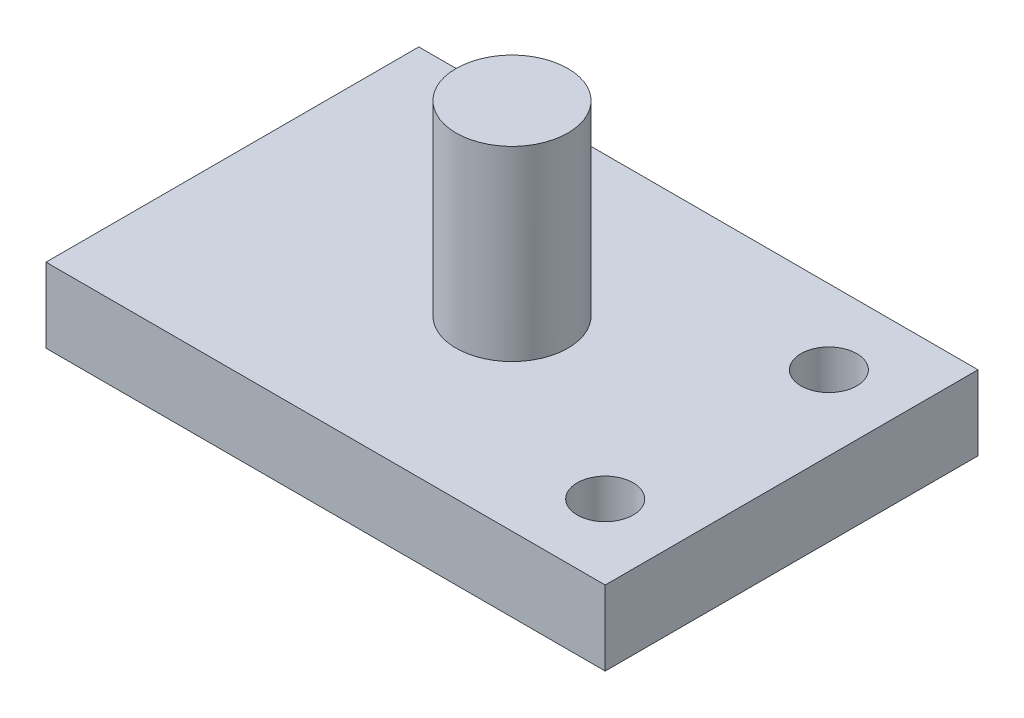
ISO-10303-21;
HEADER;
FILE_DESCRIPTION(('STEP AP214'),'2;1');
FILE_NAME('part.step','',(''),(''),'','','');
FILE_SCHEMA(('AUTOMOTIVE_DESIGN { 1 0 10303 214 1 1 1 1 }'));
ENDSEC;
DATA;
#1=APPLICATION_CONTEXT('core data for automotive mechanical design processes');
#2=APPLICATION_PROTOCOL_DEFINITION('international standard','automotive_design',2000,#1);
#3=PRODUCT_CONTEXT('',#1,'mechanical');
#4=PRODUCT('Part','Part','',(#3));
#5=PRODUCT_RELATED_PRODUCT_CATEGORY('part','',(#4));
#6=PRODUCT_DEFINITION_FORMATION('','',#4);
#7=PRODUCT_DEFINITION_CONTEXT('part definition',#1,'design');
#8=PRODUCT_DEFINITION('design','',#6,#7);
#9=PRODUCT_DEFINITION_SHAPE('','',#8);
#10=(LENGTH_UNIT() NAMED_UNIT(*) SI_UNIT(.MILLI.,.METRE.));
#11=(NAMED_UNIT(*) PLANE_ANGLE_UNIT() SI_UNIT($,.RADIAN.));
#12=(NAMED_UNIT(*) SI_UNIT($,.STERADIAN.) SOLID_ANGLE_UNIT());
#13=UNCERTAINTY_MEASURE_WITH_UNIT(LENGTH_MEASURE(1.E-05),#10,'distance_accuracy_value','');
#14=(GEOMETRIC_REPRESENTATION_CONTEXT(3) GLOBAL_UNCERTAINTY_ASSIGNED_CONTEXT((#13)) GLOBAL_UNIT_ASSIGNED_CONTEXT((#10,
#11,#12)) REPRESENTATION_CONTEXT('',''));
#15=CARTESIAN_POINT('',(0.,0.,0.));
#16=DIRECTION('',(0.,0.,1.));
#17=DIRECTION('',(1.,0.,0.));
#18=AXIS2_PLACEMENT_3D('',#15,#16,#17);
#19=CARTESIAN_POINT('',(0.,20.,0.));
#20=DIRECTION('',(0.,-1.,0.));
#21=DIRECTION('',(0.,0.,-1.));
#22=AXIS2_PLACEMENT_3D('',#19,#20,#21);
#23=PLANE('',#22);
#24=CARTESIAN_POINT('',(55.,20.,30.));
#25=DIRECTION('',(0.,1.,0.));
#26=DIRECTION('',(0.,0.,1.));
#27=AXIS2_PLACEMENT_3D('',#24,#25,#26);
#28=CIRCLE('',#27,7.5);
#29=CARTESIAN_POINT('',(55.,20.,37.5));
#30=VERTEX_POINT('',#29);
#31=EDGE_CURVE('E152',#30,#30,#28,.T.);
#32=ORIENTED_EDGE('',*,*,#31,.F.);
#33=EDGE_LOOP('',(#32));
#34=FACE_BOUND('',#33,.T.);
#35=CARTESIAN_POINT('',(55.,20.,-30.));
#36=DIRECTION('',(0.,1.,0.));
#37=DIRECTION('',(0.,0.,1.));
#38=AXIS2_PLACEMENT_3D('',#35,#36,#37);
#39=CIRCLE('',#38,7.5);
#40=CARTESIAN_POINT('',(55.,20.,-22.5));
#41=VERTEX_POINT('',#40);
#42=EDGE_CURVE('E154',#41,#41,#39,.T.);
#43=ORIENTED_EDGE('',*,*,#42,.F.);
#44=EDGE_LOOP('',(#43));
#45=FACE_BOUND('',#44,.T.);
#46=DIRECTION('',(0.,0.,-1.));
#47=VECTOR('',#46,1.);
#48=CARTESIAN_POINT('',(75.,20.,50.));
#49=LINE('',#48,#47);
#50=CARTESIAN_POINT('',(75.,20.,50.));
#51=VERTEX_POINT('',#50);
#52=CARTESIAN_POINT('',(75.,20.,-50.));
#53=VERTEX_POINT('',#52);
#54=EDGE_CURVE('E86',#51,#53,#49,.T.);
#55=ORIENTED_EDGE('',*,*,#54,.T.);
#56=DIRECTION('',(-1.,0.,0.));
#57=VECTOR('',#56,1.);
#58=CARTESIAN_POINT('',(-75.,20.,-50.));
#59=LINE('',#58,#57);
#60=CARTESIAN_POINT('',(-75.,20.,-50.));
#61=VERTEX_POINT('',#60);
#62=EDGE_CURVE('E81',#53,#61,#59,.T.);
#63=ORIENTED_EDGE('',*,*,#62,.T.);
#64=DIRECTION('',(0.,0.,1.));
#65=VECTOR('',#64,1.);
#66=CARTESIAN_POINT('',(-75.,20.,50.));
#67=LINE('',#66,#65);
#68=CARTESIAN_POINT('',(-75.,20.,50.));
#69=VERTEX_POINT('',#68);
#70=EDGE_CURVE('E84',#61,#69,#67,.T.);
#71=ORIENTED_EDGE('',*,*,#70,.T.);
#72=DIRECTION('',(1.,0.,0.));
#73=VECTOR('',#72,1.);
#74=CARTESIAN_POINT('',(-75.,20.,50.));
#75=LINE('',#74,#73);
#76=EDGE_CURVE('E50',#69,#51,#75,.T.);
#77=ORIENTED_EDGE('',*,*,#76,.T.);
#78=EDGE_LOOP('',(#55,#63,#71,#77));
#79=FACE_BOUND('',#78,.T.);
#80=CARTESIAN_POINT('',(0.,20.,0.));
#81=DIRECTION('',(0.,-1.,0.));
#82=DIRECTION('',(0.,0.,-1.));
#83=AXIS2_PLACEMENT_3D('',#80,#81,#82);
#84=CIRCLE('',#83,15.);
#85=CARTESIAN_POINT('',(0.,20.,-15.));
#86=VERTEX_POINT('',#85);
#87=EDGE_CURVE('E11',#86,#86,#84,.F.);
#88=ORIENTED_EDGE('',*,*,#87,.F.);
#89=EDGE_LOOP('',(#88));
#90=FACE_BOUND('',#89,.T.);
#91=ADVANCED_FACE('F33',(#34,#45,#79,#90),#23,.F.);
#92=CARTESIAN_POINT('',(75.,20.,50.));
#93=DIRECTION('',(-1.,0.,0.));
#94=DIRECTION('',(0.,0.,1.));
#95=AXIS2_PLACEMENT_3D('',#92,#93,#94);
#96=PLANE('',#95);
#97=DIRECTION('',(0.,0.,-1.));
#98=VECTOR('',#97,1.);
#99=CARTESIAN_POINT('',(75.,0.,50.));
#100=LINE('',#99,#98);
#101=CARTESIAN_POINT('',(75.,0.,50.));
#102=VERTEX_POINT('',#101);
#103=CARTESIAN_POINT('',(75.,0.,-50.));
#104=VERTEX_POINT('',#103);
#105=EDGE_CURVE('E100',#102,#104,#100,.T.);
#106=ORIENTED_EDGE('',*,*,#105,.T.);
#107=DIRECTION('',(0.,-1.,0.));
#108=VECTOR('',#107,1.);
#109=CARTESIAN_POINT('',(75.,20.,-50.));
#110=LINE('',#109,#108);
#111=EDGE_CURVE('E42',#53,#104,#110,.T.);
#112=ORIENTED_EDGE('',*,*,#111,.F.);
#113=ORIENTED_EDGE('',*,*,#54,.F.);
#114=DIRECTION('',(0.,-1.,0.));
#115=VECTOR('',#114,1.);
#116=CARTESIAN_POINT('',(75.,20.,50.));
#117=LINE('',#116,#115);
#118=EDGE_CURVE('E96',#51,#102,#117,.T.);
#119=ORIENTED_EDGE('',*,*,#118,.T.);
#120=EDGE_LOOP('',(#106,#112,#113,#119));
#121=FACE_BOUND('',#120,.T.);
#122=ADVANCED_FACE('F35',(#121),#96,.F.);
#123=CARTESIAN_POINT('',(-75.,20.,-50.));
#124=DIRECTION('',(0.,0.,1.));
#125=DIRECTION('',(1.,0.,0.));
#126=AXIS2_PLACEMENT_3D('',#123,#124,#125);
#127=PLANE('',#126);
#128=DIRECTION('',(-1.,0.,0.));
#129=VECTOR('',#128,1.);
#130=CARTESIAN_POINT('',(-75.,0.,-50.));
#131=LINE('',#130,#129);
#132=CARTESIAN_POINT('',(-75.,0.,-50.));
#133=VERTEX_POINT('',#132);
#134=EDGE_CURVE('E91',#104,#133,#131,.T.);
#135=ORIENTED_EDGE('',*,*,#134,.T.);
#136=DIRECTION('',(0.,-1.,0.));
#137=VECTOR('',#136,1.);
#138=CARTESIAN_POINT('',(-75.,20.,-50.));
#139=LINE('',#138,#137);
#140=EDGE_CURVE('E89',#61,#133,#139,.T.);
#141=ORIENTED_EDGE('',*,*,#140,.F.);
#142=ORIENTED_EDGE('',*,*,#62,.F.);
#143=ORIENTED_EDGE('',*,*,#111,.T.);
#144=EDGE_LOOP('',(#135,#141,#142,#143));
#145=FACE_BOUND('',#144,.T.);
#146=ADVANCED_FACE('F90',(#145),#127,.F.);
#147=CARTESIAN_POINT('',(-75.,20.,50.));
#148=DIRECTION('',(1.,0.,0.));
#149=DIRECTION('',(0.,0.,-1.));
#150=AXIS2_PLACEMENT_3D('',#147,#148,#149);
#151=PLANE('',#150);
#152=DIRECTION('',(0.,0.,1.));
#153=VECTOR('',#152,1.);
#154=CARTESIAN_POINT('',(-75.,0.,50.));
#155=LINE('',#154,#153);
#156=CARTESIAN_POINT('',(-75.,0.,50.));
#157=VERTEX_POINT('',#156);
#158=EDGE_CURVE('E67',#133,#157,#155,.T.);
#159=ORIENTED_EDGE('',*,*,#158,.T.);
#160=DIRECTION('',(0.,-1.,0.));
#161=VECTOR('',#160,1.);
#162=CARTESIAN_POINT('',(-75.,20.,50.));
#163=LINE('',#162,#161);
#164=EDGE_CURVE('E92',#69,#157,#163,.T.);
#165=ORIENTED_EDGE('',*,*,#164,.F.);
#166=ORIENTED_EDGE('',*,*,#70,.F.);
#167=ORIENTED_EDGE('',*,*,#140,.T.);
#168=EDGE_LOOP('',(#159,#165,#166,#167));
#169=FACE_BOUND('',#168,.T.);
#170=ADVANCED_FACE('F94',(#169),#151,.F.);
#171=CARTESIAN_POINT('',(-75.,20.,50.));
#172=DIRECTION('',(0.,0.,-1.));
#173=DIRECTION('',(-1.,0.,0.));
#174=AXIS2_PLACEMENT_3D('',#171,#172,#173);
#175=PLANE('',#174);
#176=DIRECTION('',(1.,0.,0.));
#177=VECTOR('',#176,1.);
#178=CARTESIAN_POINT('',(-75.,0.,50.));
#179=LINE('',#178,#177);
#180=EDGE_CURVE('E73',#157,#102,#179,.T.);
#181=ORIENTED_EDGE('',*,*,#180,.T.);
#182=ORIENTED_EDGE('',*,*,#118,.F.);
#183=ORIENTED_EDGE('',*,*,#76,.F.);
#184=ORIENTED_EDGE('',*,*,#164,.T.);
#185=EDGE_LOOP('',(#181,#182,#183,#184));
#186=FACE_BOUND('',#185,.T.);
#187=ADVANCED_FACE('F114',(#186),#175,.F.);
#188=CARTESIAN_POINT('',(0.,0.,0.));
#189=DIRECTION('',(0.,-1.,0.));
#190=DIRECTION('',(0.,0.,-1.));
#191=AXIS2_PLACEMENT_3D('',#188,#189,#190);
#192=PLANE('',#191);
#193=CARTESIAN_POINT('',(55.,0.,30.));
#194=DIRECTION('',(0.,1.,0.));
#195=DIRECTION('',(0.,0.,1.));
#196=AXIS2_PLACEMENT_3D('',#193,#194,#195);
#197=CIRCLE('',#196,7.5);
#198=CARTESIAN_POINT('',(55.,0.,37.5));
#199=VERTEX_POINT('',#198);
#200=EDGE_CURVE('E150',#199,#199,#197,.T.);
#201=ORIENTED_EDGE('',*,*,#200,.T.);
#202=EDGE_LOOP('',(#201));
#203=FACE_BOUND('',#202,.T.);
#204=CARTESIAN_POINT('',(55.,0.,-30.));
#205=DIRECTION('',(0.,1.,0.));
#206=DIRECTION('',(0.,0.,1.));
#207=AXIS2_PLACEMENT_3D('',#204,#205,#206);
#208=CIRCLE('',#207,7.5);
#209=CARTESIAN_POINT('',(55.,0.,-22.5));
#210=VERTEX_POINT('',#209);
#211=EDGE_CURVE('E157',#210,#210,#208,.T.);
#212=ORIENTED_EDGE('',*,*,#211,.T.);
#213=EDGE_LOOP('',(#212));
#214=FACE_BOUND('',#213,.T.);
#215=ORIENTED_EDGE('',*,*,#105,.F.);
#216=ORIENTED_EDGE('',*,*,#180,.F.);
#217=ORIENTED_EDGE('',*,*,#158,.F.);
#218=ORIENTED_EDGE('',*,*,#134,.F.);
#219=EDGE_LOOP('',(#215,#216,#217,#218));
#220=FACE_BOUND('',#219,.T.);
#221=ADVANCED_FACE('F111',(#203,#214,#220),#192,.T.);
#222=CARTESIAN_POINT('',(0.,70.,0.));
#223=DIRECTION('',(0.,-1.,0.));
#224=DIRECTION('',(0.,0.,-1.));
#225=AXIS2_PLACEMENT_3D('',#222,#223,#224);
#226=CYLINDRICAL_SURFACE('',#225,15.);
#227=CARTESIAN_POINT('',(0.,70.,0.));
#228=DIRECTION('',(0.,1.,0.));
#229=DIRECTION('',(0.,0.,1.));
#230=AXIS2_PLACEMENT_3D('',#227,#228,#229);
#231=CIRCLE('',#230,15.);
#232=CARTESIAN_POINT('',(0.,70.,15.));
#233=VERTEX_POINT('',#232);
#234=EDGE_CURVE('E103',#233,#233,#231,.T.);
#235=ORIENTED_EDGE('',*,*,#234,.F.);
#236=EDGE_LOOP('',(#235));
#237=FACE_BOUND('',#236,.T.);
#238=ORIENTED_EDGE('',*,*,#87,.T.);
#239=EDGE_LOOP('',(#238));
#240=FACE_BOUND('',#239,.T.);
#241=ADVANCED_FACE('F113',(#237,#240),#226,.T.);
#242=CARTESIAN_POINT('',(0.,70.,0.));
#243=DIRECTION('',(0.,1.,0.));
#244=DIRECTION('',(0.,0.,1.));
#245=AXIS2_PLACEMENT_3D('',#242,#243,#244);
#246=PLANE('',#245);
#247=ORIENTED_EDGE('',*,*,#234,.T.);
#248=EDGE_LOOP('',(#247));
#249=FACE_BOUND('',#248,.T.);
#250=ADVANCED_FACE('F121',(#249),#246,.T.);
#251=CARTESIAN_POINT('',(55.,0.,-30.));
#252=DIRECTION('',(0.,1.,0.));
#253=DIRECTION('',(0.,0.,1.));
#254=AXIS2_PLACEMENT_3D('',#251,#252,#253);
#255=CYLINDRICAL_SURFACE('',#254,7.5);
#256=ORIENTED_EDGE('',*,*,#211,.F.);
#257=EDGE_LOOP('',(#256));
#258=FACE_BOUND('',#257,.T.);
#259=ORIENTED_EDGE('',*,*,#42,.T.);
#260=EDGE_LOOP('',(#259));
#261=FACE_BOUND('',#260,.T.);
#262=ADVANCED_FACE('F138',(#258,#261),#255,.F.);
#263=CARTESIAN_POINT('',(55.,0.,30.));
#264=DIRECTION('',(0.,1.,0.));
#265=DIRECTION('',(0.,0.,1.));
#266=AXIS2_PLACEMENT_3D('',#263,#264,#265);
#267=CYLINDRICAL_SURFACE('',#266,7.5);
#268=ORIENTED_EDGE('',*,*,#200,.F.);
#269=EDGE_LOOP('',(#268));
#270=FACE_BOUND('',#269,.T.);
#271=ORIENTED_EDGE('',*,*,#31,.T.);
#272=EDGE_LOOP('',(#271));
#273=FACE_BOUND('',#272,.T.);
#274=ADVANCED_FACE('F142',(#270,#273),#267,.F.);
#275=CLOSED_SHELL('',(#91,#122,#146,#170,#187,#221,#241,#250,#262,#274));
#276=MANIFOLD_SOLID_BREP('B2',#275);
#277=ADVANCED_BREP_SHAPE_REPRESENTATION('',(#18,#276),#14);
#278=SHAPE_DEFINITION_REPRESENTATION(#9,#277);
ENDSEC;
END-ISO-10303-21;
